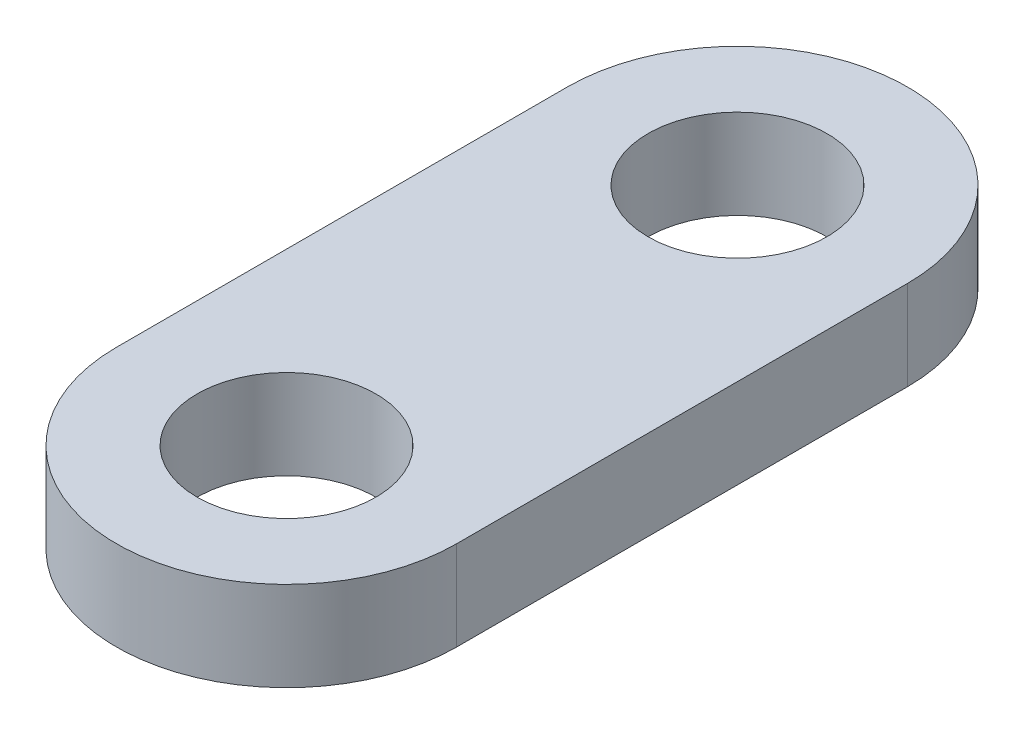
ISO-10303-21;
HEADER;
FILE_DESCRIPTION(('STEP AP214'),'2;1');
FILE_NAME('part.step','',(''),(''),'','','');
FILE_SCHEMA(('AUTOMOTIVE_DESIGN { 1 0 10303 214 1 1 1 1 }'));
ENDSEC;
DATA;
#1=APPLICATION_CONTEXT('core data for automotive mechanical design processes');
#2=APPLICATION_PROTOCOL_DEFINITION('international standard','automotive_design',2000,#1);
#3=PRODUCT_CONTEXT('',#1,'mechanical');
#4=PRODUCT('Part','Part','',(#3));
#5=PRODUCT_RELATED_PRODUCT_CATEGORY('part','',(#4));
#6=PRODUCT_DEFINITION_FORMATION('','',#4);
#7=PRODUCT_DEFINITION_CONTEXT('part definition',#1,'design');
#8=PRODUCT_DEFINITION('design','',#6,#7);
#9=PRODUCT_DEFINITION_SHAPE('','',#8);
#10=(LENGTH_UNIT() NAMED_UNIT(*) SI_UNIT(.MILLI.,.METRE.));
#11=(NAMED_UNIT(*) PLANE_ANGLE_UNIT() SI_UNIT($,.RADIAN.));
#12=(NAMED_UNIT(*) SI_UNIT($,.STERADIAN.) SOLID_ANGLE_UNIT());
#13=UNCERTAINTY_MEASURE_WITH_UNIT(LENGTH_MEASURE(1.E-05),#10,'distance_accuracy_value','');
#14=(GEOMETRIC_REPRESENTATION_CONTEXT(3) GLOBAL_UNCERTAINTY_ASSIGNED_CONTEXT((#13)) GLOBAL_UNIT_ASSIGNED_CONTEXT((#10,
#11,#12)) REPRESENTATION_CONTEXT('',''));
#15=CARTESIAN_POINT('',(0.,0.,0.));
#16=DIRECTION('',(0.,0.,1.));
#17=DIRECTION('',(1.,0.,0.));
#18=AXIS2_PLACEMENT_3D('',#15,#16,#17);
#19=CARTESIAN_POINT('',(0.,2.5,-6.5787610619469));
#20=DIRECTION('',(0.,1.,0.));
#21=DIRECTION('',(0.,0.,1.));
#22=AXIS2_PLACEMENT_3D('',#19,#20,#21);
#23=PLANE('',#22);
#24=CARTESIAN_POINT('',(0.,2.5,-6.5787610619469));
#25=DIRECTION('',(0.,1.,0.));
#26=DIRECTION('',(0.,0.,1.));
#27=AXIS2_PLACEMENT_3D('',#24,#25,#26);
#28=CIRCLE('',#27,2.5);
#29=CARTESIAN_POINT('',(0.,2.5,-4.0787610619469));
#30=VERTEX_POINT('',#29);
#31=EDGE_CURVE('E100',#30,#30,#28,.T.);
#32=ORIENTED_EDGE('',*,*,#31,.F.);
#33=EDGE_LOOP('',(#32));
#34=FACE_BOUND('',#33,.T.);
#35=CARTESIAN_POINT('',(0.,2.5,-6.5787610619469));
#36=DIRECTION('',(0.,1.,0.));
#37=DIRECTION('',(0.,0.,1.));
#38=AXIS2_PLACEMENT_3D('',#35,#36,#37);
#39=CIRCLE('',#38,4.75292795575222);
#40=CARTESIAN_POINT('',(4.75292795575222,2.5,-6.5787610619469));
#41=VERTEX_POINT('',#40);
#42=CARTESIAN_POINT('',(-4.75292795575222,2.5,-6.5787610619469));
#43=VERTEX_POINT('',#42);
#44=EDGE_CURVE('E85',#41,#43,#39,.T.);
#45=ORIENTED_EDGE('',*,*,#44,.T.);
#46=DIRECTION('',(0.,0.,1.));
#47=VECTOR('',#46,1.);
#48=CARTESIAN_POINT('',(-4.75292795575222,2.5,-6.5787610619469));
#49=LINE('',#48,#47);
#50=CARTESIAN_POINT('',(-4.75292795575222,2.5,6.0212389380531));
#51=VERTEX_POINT('',#50);
#52=EDGE_CURVE('E80',#43,#51,#49,.T.);
#53=ORIENTED_EDGE('',*,*,#52,.T.);
#54=CARTESIAN_POINT('',(0.,2.5,6.0212389380531));
#55=DIRECTION('',(0.,1.,0.));
#56=DIRECTION('',(0.,0.,1.));
#57=AXIS2_PLACEMENT_3D('',#54,#55,#56);
#58=CIRCLE('',#57,4.75292795575222);
#59=CARTESIAN_POINT('',(4.75292795575222,2.5,6.0212389380531));
#60=VERTEX_POINT('',#59);
#61=EDGE_CURVE('E83',#51,#60,#58,.T.);
#62=ORIENTED_EDGE('',*,*,#61,.T.);
#63=DIRECTION('',(0.,0.,-1.));
#64=VECTOR('',#63,1.);
#65=CARTESIAN_POINT('',(4.75292795575222,2.5,-6.5787610619469));
#66=LINE('',#65,#64);
#67=EDGE_CURVE('E50',#60,#41,#66,.T.);
#68=ORIENTED_EDGE('',*,*,#67,.T.);
#69=EDGE_LOOP('',(#45,#53,#62,#68));
#70=FACE_BOUND('',#69,.T.);
#71=CARTESIAN_POINT('',(0.,2.5,6.0212389380531));
#72=DIRECTION('',(0.,1.,0.));
#73=DIRECTION('',(0.,0.,1.));
#74=AXIS2_PLACEMENT_3D('',#71,#72,#73);
#75=CIRCLE('',#74,2.5);
#76=CARTESIAN_POINT('',(0.,2.5,8.5212389380531));
#77=VERTEX_POINT('',#76);
#78=EDGE_CURVE('E115',#77,#77,#75,.T.);
#79=ORIENTED_EDGE('',*,*,#78,.F.);
#80=EDGE_LOOP('',(#79));
#81=FACE_BOUND('',#80,.T.);
#82=ADVANCED_FACE('F33',(#34,#70,#81),#23,.T.);
#83=CARTESIAN_POINT('',(0.,0.,-6.5787610619469));
#84=DIRECTION('',(0.,1.,0.));
#85=DIRECTION('',(0.,0.,1.));
#86=AXIS2_PLACEMENT_3D('',#83,#84,#85);
#87=PLANE('',#86);
#88=CARTESIAN_POINT('',(0.,0.,-6.5787610619469));
#89=DIRECTION('',(0.,1.,0.));
#90=DIRECTION('',(0.,0.,1.));
#91=AXIS2_PLACEMENT_3D('',#88,#89,#90);
#92=CIRCLE('',#91,4.75292795575222);
#93=CARTESIAN_POINT('',(4.75292795575222,0.,-6.5787610619469));
#94=VERTEX_POINT('',#93);
#95=CARTESIAN_POINT('',(-4.75292795575222,0.,-6.5787610619469));
#96=VERTEX_POINT('',#95);
#97=EDGE_CURVE('E97',#94,#96,#92,.T.);
#98=ORIENTED_EDGE('',*,*,#97,.F.);
#99=DIRECTION('',(0.,0.,-1.));
#100=VECTOR('',#99,1.);
#101=CARTESIAN_POINT('',(4.75292795575222,0.,-6.5787610619469));
#102=LINE('',#101,#100);
#103=CARTESIAN_POINT('',(4.75292795575222,0.,6.0212389380531));
#104=VERTEX_POINT('',#103);
#105=EDGE_CURVE('E73',#104,#94,#102,.T.);
#106=ORIENTED_EDGE('',*,*,#105,.F.);
#107=CARTESIAN_POINT('',(0.,0.,6.0212389380531));
#108=DIRECTION('',(0.,1.,0.));
#109=DIRECTION('',(0.,0.,1.));
#110=AXIS2_PLACEMENT_3D('',#107,#108,#109);
#111=CIRCLE('',#110,4.75292795575222);
#112=CARTESIAN_POINT('',(-4.75292795575222,0.,6.0212389380531));
#113=VERTEX_POINT('',#112);
#114=EDGE_CURVE('E67',#113,#104,#111,.T.);
#115=ORIENTED_EDGE('',*,*,#114,.F.);
#116=DIRECTION('',(0.,0.,1.));
#117=VECTOR('',#116,1.);
#118=CARTESIAN_POINT('',(-4.75292795575222,0.,-6.5787610619469));
#119=LINE('',#118,#117);
#120=EDGE_CURVE('E89',#96,#113,#119,.T.);
#121=ORIENTED_EDGE('',*,*,#120,.F.);
#122=EDGE_LOOP('',(#98,#106,#115,#121));
#123=FACE_BOUND('',#122,.T.);
#124=CARTESIAN_POINT('',(0.,0.,-6.5787610619469));
#125=DIRECTION('',(0.,1.,0.));
#126=DIRECTION('',(0.,0.,1.));
#127=AXIS2_PLACEMENT_3D('',#124,#125,#126);
#128=CIRCLE('',#127,2.5);
#129=CARTESIAN_POINT('',(0.,0.,-4.0787610619469));
#130=VERTEX_POINT('',#129);
#131=EDGE_CURVE('E112',#130,#130,#128,.T.);
#132=ORIENTED_EDGE('',*,*,#131,.T.);
#133=EDGE_LOOP('',(#132));
#134=FACE_BOUND('',#133,.T.);
#135=CARTESIAN_POINT('',(0.,0.,6.0212389380531));
#136=DIRECTION('',(0.,1.,0.));
#137=DIRECTION('',(0.,0.,1.));
#138=AXIS2_PLACEMENT_3D('',#135,#136,#137);
#139=CIRCLE('',#138,2.5);
#140=CARTESIAN_POINT('',(0.,0.,8.5212389380531));
#141=VERTEX_POINT('',#140);
#142=EDGE_CURVE('E118',#141,#141,#139,.T.);
#143=ORIENTED_EDGE('',*,*,#142,.T.);
#144=EDGE_LOOP('',(#143));
#145=FACE_BOUND('',#144,.T.);
#146=ADVANCED_FACE('F108',(#123,#134,#145),#87,.F.);
#147=CARTESIAN_POINT('',(0.,2.5,-6.5787610619469));
#148=DIRECTION('',(0.,-1.,0.));
#149=DIRECTION('',(0.,0.,-1.));
#150=AXIS2_PLACEMENT_3D('',#147,#148,#149);
#151=CYLINDRICAL_SURFACE('',#150,4.75292795575222);
#152=ORIENTED_EDGE('',*,*,#97,.T.);
#153=DIRECTION('',(0.,-1.,0.));
#154=VECTOR('',#153,1.);
#155=CARTESIAN_POINT('',(-4.75292795575222,2.5,-6.5787610619469));
#156=LINE('',#155,#154);
#157=EDGE_CURVE('E11',#43,#96,#156,.T.);
#158=ORIENTED_EDGE('',*,*,#157,.F.);
#159=ORIENTED_EDGE('',*,*,#44,.F.);
#160=DIRECTION('',(0.,-1.,0.));
#161=VECTOR('',#160,1.);
#162=CARTESIAN_POINT('',(4.75292795575222,2.5,-6.5787610619469));
#163=LINE('',#162,#161);
#164=EDGE_CURVE('E93',#41,#94,#163,.T.);
#165=ORIENTED_EDGE('',*,*,#164,.T.);
#166=EDGE_LOOP('',(#152,#158,#159,#165));
#167=FACE_BOUND('',#166,.T.);
#168=ADVANCED_FACE('F35',(#167),#151,.T.);
#169=CARTESIAN_POINT('',(-4.75292795575222,2.5,-6.5787610619469));
#170=DIRECTION('',(1.,0.,0.));
#171=DIRECTION('',(0.,0.,-1.));
#172=AXIS2_PLACEMENT_3D('',#169,#170,#171);
#173=PLANE('',#172);
#174=ORIENTED_EDGE('',*,*,#120,.T.);
#175=DIRECTION('',(0.,-1.,0.));
#176=VECTOR('',#175,1.);
#177=CARTESIAN_POINT('',(-4.75292795575222,2.5,6.0212389380531));
#178=LINE('',#177,#176);
#179=EDGE_CURVE('E42',#51,#113,#178,.T.);
#180=ORIENTED_EDGE('',*,*,#179,.F.);
#181=ORIENTED_EDGE('',*,*,#52,.F.);
#182=ORIENTED_EDGE('',*,*,#157,.T.);
#183=EDGE_LOOP('',(#174,#180,#181,#182));
#184=FACE_BOUND('',#183,.T.);
#185=ADVANCED_FACE('F88',(#184),#173,.F.);
#186=CARTESIAN_POINT('',(0.,2.5,6.0212389380531));
#187=DIRECTION('',(0.,-1.,0.));
#188=DIRECTION('',(0.,0.,-1.));
#189=AXIS2_PLACEMENT_3D('',#186,#187,#188);
#190=CYLINDRICAL_SURFACE('',#189,4.75292795575222);
#191=ORIENTED_EDGE('',*,*,#114,.T.);
#192=DIRECTION('',(0.,-1.,0.));
#193=VECTOR('',#192,1.);
#194=CARTESIAN_POINT('',(4.75292795575222,2.5,6.0212389380531));
#195=LINE('',#194,#193);
#196=EDGE_CURVE('E90',#60,#104,#195,.T.);
#197=ORIENTED_EDGE('',*,*,#196,.F.);
#198=ORIENTED_EDGE('',*,*,#61,.F.);
#199=ORIENTED_EDGE('',*,*,#179,.T.);
#200=EDGE_LOOP('',(#191,#197,#198,#199));
#201=FACE_BOUND('',#200,.T.);
#202=ADVANCED_FACE('F91',(#201),#190,.T.);
#203=CARTESIAN_POINT('',(4.75292795575222,2.5,-6.5787610619469));
#204=DIRECTION('',(-1.,0.,0.));
#205=DIRECTION('',(0.,0.,1.));
#206=AXIS2_PLACEMENT_3D('',#203,#204,#205);
#207=PLANE('',#206);
#208=ORIENTED_EDGE('',*,*,#105,.T.);
#209=ORIENTED_EDGE('',*,*,#164,.F.);
#210=ORIENTED_EDGE('',*,*,#67,.F.);
#211=ORIENTED_EDGE('',*,*,#196,.T.);
#212=EDGE_LOOP('',(#208,#209,#210,#211));
#213=FACE_BOUND('',#212,.T.);
#214=ADVANCED_FACE('F105',(#213),#207,.F.);
#215=CARTESIAN_POINT('',(0.,2.5,-6.5787610619469));
#216=DIRECTION('',(0.,-1.,0.));
#217=DIRECTION('',(0.,0.,-1.));
#218=AXIS2_PLACEMENT_3D('',#215,#216,#217);
#219=CYLINDRICAL_SURFACE('',#218,2.5);
#220=ORIENTED_EDGE('',*,*,#31,.T.);
#221=EDGE_LOOP('',(#220));
#222=FACE_BOUND('',#221,.T.);
#223=ORIENTED_EDGE('',*,*,#131,.F.);
#224=EDGE_LOOP('',(#223));
#225=FACE_BOUND('',#224,.T.);
#226=ADVANCED_FACE('F135',(#222,#225),#219,.F.);
#227=CARTESIAN_POINT('',(0.,2.5,6.0212389380531));
#228=DIRECTION('',(0.,-1.,0.));
#229=DIRECTION('',(0.,0.,-1.));
#230=AXIS2_PLACEMENT_3D('',#227,#228,#229);
#231=CYLINDRICAL_SURFACE('',#230,2.5);
#232=ORIENTED_EDGE('',*,*,#78,.T.);
#233=EDGE_LOOP('',(#232));
#234=FACE_BOUND('',#233,.T.);
#235=ORIENTED_EDGE('',*,*,#142,.F.);
#236=EDGE_LOOP('',(#235));
#237=FACE_BOUND('',#236,.T.);
#238=ADVANCED_FACE('F124',(#234,#237),#231,.F.);
#239=CLOSED_SHELL('',(#82,#146,#168,#185,#202,#214,#226,#238));
#240=MANIFOLD_SOLID_BREP('B2',#239);
#241=ADVANCED_BREP_SHAPE_REPRESENTATION('',(#18,#240),#14);
#242=SHAPE_DEFINITION_REPRESENTATION(#9,#241);
ENDSEC;
END-ISO-10303-21;
